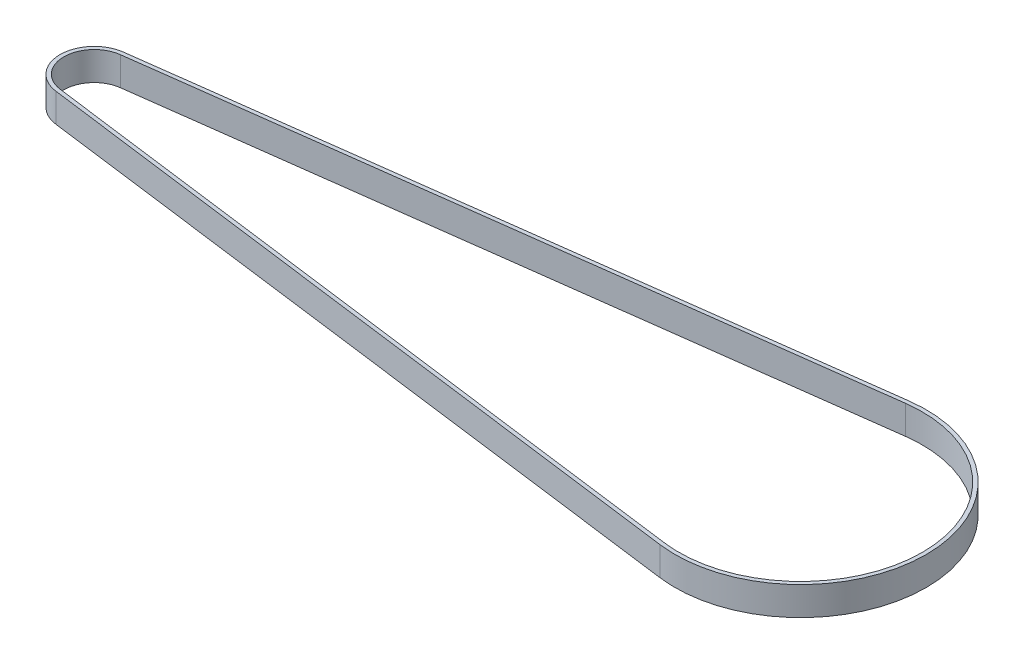
ISO-10303-21;
HEADER;
FILE_DESCRIPTION(('STEP AP214'),'2;1');
FILE_NAME('part.step','',(''),(''),'','','');
FILE_SCHEMA(('AUTOMOTIVE_DESIGN { 1 0 10303 214 1 1 1 1 }'));
ENDSEC;
DATA;
#1=APPLICATION_CONTEXT('core data for automotive mechanical design processes');
#2=APPLICATION_PROTOCOL_DEFINITION('international standard','automotive_design',2000,#1);
#3=PRODUCT_CONTEXT('',#1,'mechanical');
#4=PRODUCT('Part','Part','',(#3));
#5=PRODUCT_RELATED_PRODUCT_CATEGORY('part','',(#4));
#6=PRODUCT_DEFINITION_FORMATION('','',#4);
#7=PRODUCT_DEFINITION_CONTEXT('part definition',#1,'design');
#8=PRODUCT_DEFINITION('design','',#6,#7);
#9=PRODUCT_DEFINITION_SHAPE('','',#8);
#10=(LENGTH_UNIT() NAMED_UNIT(*) SI_UNIT(.MILLI.,.METRE.));
#11=(NAMED_UNIT(*) PLANE_ANGLE_UNIT() SI_UNIT($,.RADIAN.));
#12=(NAMED_UNIT(*) SI_UNIT($,.STERADIAN.) SOLID_ANGLE_UNIT());
#13=UNCERTAINTY_MEASURE_WITH_UNIT(LENGTH_MEASURE(1.E-05),#10,'distance_accuracy_value','');
#14=(GEOMETRIC_REPRESENTATION_CONTEXT(3) GLOBAL_UNCERTAINTY_ASSIGNED_CONTEXT((#13)) GLOBAL_UNIT_ASSIGNED_CONTEXT((#10,
#11,#12)) REPRESENTATION_CONTEXT('',''));
#15=CARTESIAN_POINT('',(0.,0.,0.));
#16=DIRECTION('',(0.,0.,1.));
#17=DIRECTION('',(1.,0.,0.));
#18=AXIS2_PLACEMENT_3D('',#15,#16,#17);
#19=CARTESIAN_POINT('',(-148.,6.,0.));
#20=DIRECTION('',(0.,1.,0.));
#21=DIRECTION('',(0.,0.,1.));
#22=AXIS2_PLACEMENT_3D('',#19,#20,#21);
#23=PLANE('',#22);
#24=CARTESIAN_POINT('',(-148.,6.,0.));
#25=DIRECTION('',(0.,1.,0.));
#26=DIRECTION('',(0.,0.,1.));
#27=AXIS2_PLACEMENT_3D('',#24,#25,#26);
#28=CIRCLE('',#27,7.15);
#29=CARTESIAN_POINT('',(-148.925152027027,6.,-7.08989377402001));
#30=VERTEX_POINT('',#29);
#31=CARTESIAN_POINT('',(-148.925152027027,6.,7.08989377402001));
#32=VERTEX_POINT('',#31);
#33=EDGE_CURVE('E133',#30,#32,#28,.T.);
#34=ORIENTED_EDGE('',*,*,#33,.T.);
#35=DIRECTION('',(0.991593534827974,0.,0.129391891891892));
#36=VECTOR('',#35,1.);
#37=CARTESIAN_POINT('',(-148.925152027027,6.,7.08989377402001));
#38=LINE('',#37,#36);
#39=CARTESIAN_POINT('',(-3.40300675675676,6.,26.0789099659757));
#40=VERTEX_POINT('',#39);
#41=EDGE_CURVE('E136',#32,#40,#38,.T.);
#42=ORIENTED_EDGE('',*,*,#41,.T.);
#43=CARTESIAN_POINT('',(0.,6.,0.));
#44=DIRECTION('',(0.,1.,0.));
#45=DIRECTION('',(0.,0.,1.));
#46=AXIS2_PLACEMENT_3D('',#43,#44,#45);
#47=CIRCLE('',#46,26.3);
#48=CARTESIAN_POINT('',(-3.40300675675673,6.,-26.0789099659757));
#49=VERTEX_POINT('',#48);
#50=EDGE_CURVE('E139',#40,#49,#47,.T.);
#51=ORIENTED_EDGE('',*,*,#50,.T.);
#52=DIRECTION('',(-0.991593534827974,0.,0.129391891891892));
#53=VECTOR('',#52,1.);
#54=CARTESIAN_POINT('',(-148.925152027027,6.,-7.08989377402001));
#55=LINE('',#54,#53);
#56=EDGE_CURVE('E141',#49,#30,#55,.T.);
#57=ORIENTED_EDGE('',*,*,#56,.T.);
#58=EDGE_LOOP('',(#34,#42,#51,#57));
#59=FACE_BOUND('',#58,.T.);
#60=DIRECTION('',(0.991593534827974,0.,0.129391891891892));
#61=VECTOR('',#60,1.);
#62=CARTESIAN_POINT('',(-148.821638513514,6.,6.29661894615764));
#63=LINE('',#62,#61);
#64=CARTESIAN_POINT('',(-148.821638513514,6.,6.29661894615764));
#65=VERTEX_POINT('',#64);
#66=CARTESIAN_POINT('',(-3.29949324324324,6.,25.2856351381133));
#67=VERTEX_POINT('',#66);
#68=EDGE_CURVE('E105',#65,#67,#63,.T.);
#69=ORIENTED_EDGE('',*,*,#68,.F.);
#70=CARTESIAN_POINT('',(-148.,6.,0.));
#71=DIRECTION('',(0.,1.,0.));
#72=DIRECTION('',(0.,0.,1.));
#73=AXIS2_PLACEMENT_3D('',#70,#71,#72);
#74=CIRCLE('',#73,6.35);
#75=CARTESIAN_POINT('',(-148.821638513514,6.,-6.29661894615763));
#76=VERTEX_POINT('',#75);
#77=EDGE_CURVE('E97',#76,#65,#74,.T.);
#78=ORIENTED_EDGE('',*,*,#77,.F.);
#79=DIRECTION('',(-0.991593534827974,0.,0.129391891891892));
#80=VECTOR('',#79,1.);
#81=CARTESIAN_POINT('',(-148.821638513514,6.,-6.29661894615763));
#82=LINE('',#81,#80);
#83=CARTESIAN_POINT('',(-3.29949324324322,6.,-25.2856351381133));
#84=VERTEX_POINT('',#83);
#85=EDGE_CURVE('E119',#84,#76,#82,.T.);
#86=ORIENTED_EDGE('',*,*,#85,.F.);
#87=CARTESIAN_POINT('',(0.,6.,0.));
#88=DIRECTION('',(0.,1.,0.));
#89=DIRECTION('',(0.,0.,1.));
#90=AXIS2_PLACEMENT_3D('',#87,#88,#89);
#91=CIRCLE('',#90,25.5);
#92=EDGE_CURVE('E117',#67,#84,#91,.T.);
#93=ORIENTED_EDGE('',*,*,#92,.F.);
#94=EDGE_LOOP('',(#69,#78,#86,#93));
#95=FACE_BOUND('',#94,.T.);
#96=ADVANCED_FACE('F32',(#59,#95),#23,.T.);
#97=CARTESIAN_POINT('',(-148.,0.,0.));
#98=DIRECTION('',(0.,1.,0.));
#99=DIRECTION('',(0.,0.,1.));
#100=AXIS2_PLACEMENT_3D('',#97,#98,#99);
#101=PLANE('',#100);
#102=CARTESIAN_POINT('',(-148.,0.,0.));
#103=DIRECTION('',(0.,1.,0.));
#104=DIRECTION('',(0.,0.,1.));
#105=AXIS2_PLACEMENT_3D('',#102,#103,#104);
#106=CIRCLE('',#105,7.15);
#107=CARTESIAN_POINT('',(-148.925152027027,0.,-7.08989377402001));
#108=VERTEX_POINT('',#107);
#109=CARTESIAN_POINT('',(-148.925152027027,0.,7.08989377402001));
#110=VERTEX_POINT('',#109);
#111=EDGE_CURVE('E113',#108,#110,#106,.T.);
#112=ORIENTED_EDGE('',*,*,#111,.F.);
#113=DIRECTION('',(-0.991593534827974,0.,0.129391891891892));
#114=VECTOR('',#113,1.);
#115=CARTESIAN_POINT('',(-148.925152027027,0.,-7.08989377402001));
#116=LINE('',#115,#114);
#117=CARTESIAN_POINT('',(-3.40300675675673,0.,-26.0789099659757));
#118=VERTEX_POINT('',#117);
#119=EDGE_CURVE('E137',#118,#108,#116,.T.);
#120=ORIENTED_EDGE('',*,*,#119,.F.);
#121=CARTESIAN_POINT('',(0.,0.,0.));
#122=DIRECTION('',(0.,1.,0.));
#123=DIRECTION('',(0.,0.,1.));
#124=AXIS2_PLACEMENT_3D('',#121,#122,#123);
#125=CIRCLE('',#124,26.3);
#126=CARTESIAN_POINT('',(-3.40300675675676,0.,26.0789099659757));
#127=VERTEX_POINT('',#126);
#128=EDGE_CURVE('E148',#127,#118,#125,.T.);
#129=ORIENTED_EDGE('',*,*,#128,.F.);
#130=DIRECTION('',(0.991593534827974,0.,0.129391891891892));
#131=VECTOR('',#130,1.);
#132=CARTESIAN_POINT('',(-148.925152027027,0.,7.08989377402001));
#133=LINE('',#132,#131);
#134=EDGE_CURVE('E146',#110,#127,#133,.T.);
#135=ORIENTED_EDGE('',*,*,#134,.F.);
#136=EDGE_LOOP('',(#112,#120,#129,#135));
#137=FACE_BOUND('',#136,.T.);
#138=CARTESIAN_POINT('',(-148.,0.,0.));
#139=DIRECTION('',(0.,1.,0.));
#140=DIRECTION('',(0.,0.,1.));
#141=AXIS2_PLACEMENT_3D('',#138,#139,#140);
#142=CIRCLE('',#141,6.35);
#143=CARTESIAN_POINT('',(-148.821638513514,0.,-6.29661894615764));
#144=VERTEX_POINT('',#143);
#145=CARTESIAN_POINT('',(-148.821638513514,0.,6.29661894615764));
#146=VERTEX_POINT('',#145);
#147=EDGE_CURVE('E55',#144,#146,#142,.T.);
#148=ORIENTED_EDGE('',*,*,#147,.T.);
#149=DIRECTION('',(0.991593534827974,0.,0.129391891891892));
#150=VECTOR('',#149,1.);
#151=CARTESIAN_POINT('',(-148.821638513514,0.,6.29661894615764));
#152=LINE('',#151,#150);
#153=CARTESIAN_POINT('',(-3.29949324324324,0.,25.2856351381133));
#154=VERTEX_POINT('',#153);
#155=EDGE_CURVE('E112',#146,#154,#152,.T.);
#156=ORIENTED_EDGE('',*,*,#155,.T.);
#157=CARTESIAN_POINT('',(0.,0.,0.));
#158=DIRECTION('',(0.,1.,0.));
#159=DIRECTION('',(0.,0.,1.));
#160=AXIS2_PLACEMENT_3D('',#157,#158,#159);
#161=CIRCLE('',#160,25.5);
#162=CARTESIAN_POINT('',(-3.29949324324321,0.,-25.2856351381133));
#163=VERTEX_POINT('',#162);
#164=EDGE_CURVE('E125',#154,#163,#161,.T.);
#165=ORIENTED_EDGE('',*,*,#164,.T.);
#166=DIRECTION('',(-0.991593534827974,0.,0.129391891891892));
#167=VECTOR('',#166,1.);
#168=CARTESIAN_POINT('',(-148.821638513514,0.,-6.29661894615763));
#169=LINE('',#168,#167);
#170=EDGE_CURVE('E106',#163,#144,#169,.T.);
#171=ORIENTED_EDGE('',*,*,#170,.T.);
#172=EDGE_LOOP('',(#148,#156,#165,#171));
#173=FACE_BOUND('',#172,.T.);
#174=ADVANCED_FACE('F166',(#137,#173),#101,.F.);
#175=CARTESIAN_POINT('',(-148.,6.,0.));
#176=DIRECTION('',(0.,-1.,0.));
#177=DIRECTION('',(0.,0.,-1.));
#178=AXIS2_PLACEMENT_3D('',#175,#176,#177);
#179=CYLINDRICAL_SURFACE('',#178,7.15);
#180=ORIENTED_EDGE('',*,*,#111,.T.);
#181=DIRECTION('',(0.,-1.,0.));
#182=VECTOR('',#181,1.);
#183=CARTESIAN_POINT('',(-148.925152027027,6.,7.08989377402001));
#184=LINE('',#183,#182);
#185=EDGE_CURVE('E11',#32,#110,#184,.T.);
#186=ORIENTED_EDGE('',*,*,#185,.F.);
#187=ORIENTED_EDGE('',*,*,#33,.F.);
#188=DIRECTION('',(0.,-1.,0.));
#189=VECTOR('',#188,1.);
#190=CARTESIAN_POINT('',(-148.925152027027,6.,-7.08989377402001));
#191=LINE('',#190,#189);
#192=EDGE_CURVE('E143',#30,#108,#191,.T.);
#193=ORIENTED_EDGE('',*,*,#192,.T.);
#194=EDGE_LOOP('',(#180,#186,#187,#193));
#195=FACE_BOUND('',#194,.T.);
#196=ADVANCED_FACE('F34',(#195),#179,.T.);
#197=CARTESIAN_POINT('',(-148.925152027027,6.,7.08989377402001));
#198=DIRECTION('',(0.129391891891892,0.,-0.991593534827974));
#199=DIRECTION('',(-0.991593534827974,0.,-0.129391891891892));
#200=AXIS2_PLACEMENT_3D('',#197,#198,#199);
#201=PLANE('',#200);
#202=ORIENTED_EDGE('',*,*,#134,.T.);
#203=DIRECTION('',(0.,-1.,0.));
#204=VECTOR('',#203,1.);
#205=CARTESIAN_POINT('',(-3.40300675675676,6.,26.0789099659757));
#206=LINE('',#205,#204);
#207=EDGE_CURVE('E40',#40,#127,#206,.T.);
#208=ORIENTED_EDGE('',*,*,#207,.F.);
#209=ORIENTED_EDGE('',*,*,#41,.F.);
#210=ORIENTED_EDGE('',*,*,#185,.T.);
#211=EDGE_LOOP('',(#202,#208,#209,#210));
#212=FACE_BOUND('',#211,.T.);
#213=ADVANCED_FACE('F176',(#212),#201,.F.);
#214=CARTESIAN_POINT('',(0.,6.,0.));
#215=DIRECTION('',(0.,-1.,0.));
#216=DIRECTION('',(0.,0.,-1.));
#217=AXIS2_PLACEMENT_3D('',#214,#215,#216);
#218=CYLINDRICAL_SURFACE('',#217,26.3);
#219=ORIENTED_EDGE('',*,*,#128,.T.);
#220=DIRECTION('',(0.,-1.,0.));
#221=VECTOR('',#220,1.);
#222=CARTESIAN_POINT('',(-3.40300675675673,6.,-26.0789099659757));
#223=LINE('',#222,#221);
#224=EDGE_CURVE('E153',#49,#118,#223,.T.);
#225=ORIENTED_EDGE('',*,*,#224,.F.);
#226=ORIENTED_EDGE('',*,*,#50,.F.);
#227=ORIENTED_EDGE('',*,*,#207,.T.);
#228=EDGE_LOOP('',(#219,#225,#226,#227));
#229=FACE_BOUND('',#228,.T.);
#230=ADVANCED_FACE('F160',(#229),#218,.T.);
#231=CARTESIAN_POINT('',(-148.925152027027,6.,-7.08989377402001));
#232=DIRECTION('',(0.129391891891892,0.,0.991593534827974));
#233=DIRECTION('',(0.991593534827974,0.,-0.129391891891892));
#234=AXIS2_PLACEMENT_3D('',#231,#232,#233);
#235=PLANE('',#234);
#236=ORIENTED_EDGE('',*,*,#119,.T.);
#237=ORIENTED_EDGE('',*,*,#192,.F.);
#238=ORIENTED_EDGE('',*,*,#56,.F.);
#239=ORIENTED_EDGE('',*,*,#224,.T.);
#240=EDGE_LOOP('',(#236,#237,#238,#239));
#241=FACE_BOUND('',#240,.T.);
#242=ADVANCED_FACE('F170',(#241),#235,.F.);
#243=CARTESIAN_POINT('',(-148.,6.,0.));
#244=DIRECTION('',(0.,-1.,0.));
#245=DIRECTION('',(0.,0.,-1.));
#246=AXIS2_PLACEMENT_3D('',#243,#244,#245);
#247=CYLINDRICAL_SURFACE('',#246,6.35);
#248=ORIENTED_EDGE('',*,*,#147,.F.);
#249=DIRECTION('',(0.,-1.,0.));
#250=VECTOR('',#249,1.);
#251=CARTESIAN_POINT('',(-148.821638513514,6.,-6.29661894615763));
#252=LINE('',#251,#250);
#253=EDGE_CURVE('E101',#76,#144,#252,.T.);
#254=ORIENTED_EDGE('',*,*,#253,.F.);
#255=ORIENTED_EDGE('',*,*,#77,.T.);
#256=DIRECTION('',(0.,-1.,0.));
#257=VECTOR('',#256,1.);
#258=CARTESIAN_POINT('',(-148.821638513514,6.,6.29661894615764));
#259=LINE('',#258,#257);
#260=EDGE_CURVE('E100',#65,#146,#259,.T.);
#261=ORIENTED_EDGE('',*,*,#260,.T.);
#262=EDGE_LOOP('',(#248,#254,#255,#261));
#263=FACE_BOUND('',#262,.T.);
#264=ADVANCED_FACE('F99',(#263),#247,.F.);
#265=CARTESIAN_POINT('',(-148.821638513514,6.,6.29661894615764));
#266=DIRECTION('',(0.129391891891892,0.,-0.991593534827974));
#267=DIRECTION('',(-0.991593534827974,0.,-0.129391891891892));
#268=AXIS2_PLACEMENT_3D('',#265,#266,#267);
#269=PLANE('',#268);
#270=ORIENTED_EDGE('',*,*,#155,.F.);
#271=ORIENTED_EDGE('',*,*,#260,.F.);
#272=ORIENTED_EDGE('',*,*,#68,.T.);
#273=DIRECTION('',(0.,-1.,0.));
#274=VECTOR('',#273,1.);
#275=CARTESIAN_POINT('',(-3.29949324324324,6.,25.2856351381133));
#276=LINE('',#275,#274);
#277=EDGE_CURVE('E114',#67,#154,#276,.T.);
#278=ORIENTED_EDGE('',*,*,#277,.T.);
#279=EDGE_LOOP('',(#270,#271,#272,#278));
#280=FACE_BOUND('',#279,.T.);
#281=ADVANCED_FACE('F109',(#280),#269,.T.);
#282=CARTESIAN_POINT('',(0.,6.,0.));
#283=DIRECTION('',(0.,-1.,0.));
#284=DIRECTION('',(0.,0.,-1.));
#285=AXIS2_PLACEMENT_3D('',#282,#283,#284);
#286=CYLINDRICAL_SURFACE('',#285,25.5);
#287=ORIENTED_EDGE('',*,*,#164,.F.);
#288=ORIENTED_EDGE('',*,*,#277,.F.);
#289=ORIENTED_EDGE('',*,*,#92,.T.);
#290=DIRECTION('',(0.,-1.,0.));
#291=VECTOR('',#290,1.);
#292=CARTESIAN_POINT('',(-3.29949324324321,6.,-25.2856351381133));
#293=LINE('',#292,#291);
#294=EDGE_CURVE('E47',#84,#163,#293,.T.);
#295=ORIENTED_EDGE('',*,*,#294,.T.);
#296=EDGE_LOOP('',(#287,#288,#289,#295));
#297=FACE_BOUND('',#296,.T.);
#298=ADVANCED_FACE('F199',(#297),#286,.F.);
#299=CARTESIAN_POINT('',(-148.821638513514,6.,-6.29661894615763));
#300=DIRECTION('',(0.129391891891892,0.,0.991593534827974));
#301=DIRECTION('',(0.991593534827974,0.,-0.129391891891892));
#302=AXIS2_PLACEMENT_3D('',#299,#300,#301);
#303=PLANE('',#302);
#304=ORIENTED_EDGE('',*,*,#170,.F.);
#305=ORIENTED_EDGE('',*,*,#294,.F.);
#306=ORIENTED_EDGE('',*,*,#85,.T.);
#307=ORIENTED_EDGE('',*,*,#253,.T.);
#308=EDGE_LOOP('',(#304,#305,#306,#307));
#309=FACE_BOUND('',#308,.T.);
#310=ADVANCED_FACE('F203',(#309),#303,.T.);
#311=CLOSED_SHELL('',(#96,#174,#196,#213,#230,#242,#264,#281,#298,#310));
#312=MANIFOLD_SOLID_BREP('B2',#311);
#313=ADVANCED_BREP_SHAPE_REPRESENTATION('',(#18,#312),#14);
#314=SHAPE_DEFINITION_REPRESENTATION(#9,#313);
ENDSEC;
END-ISO-10303-21;
